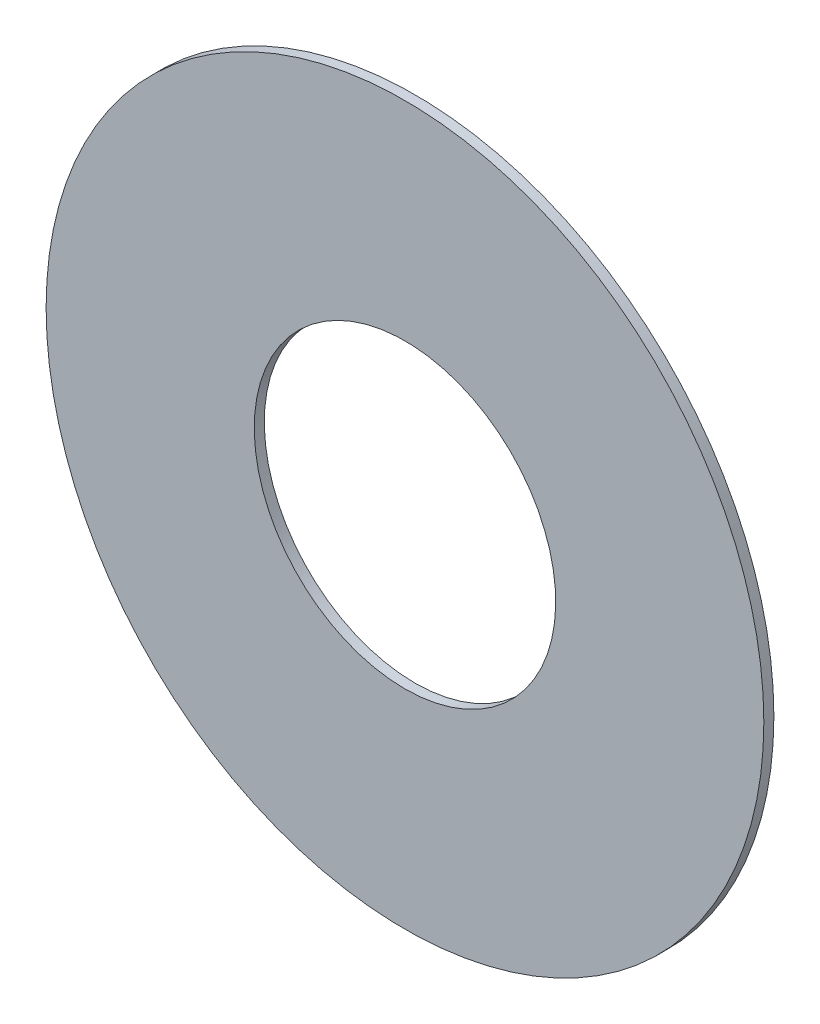
ISO-10303-21;
HEADER;
FILE_DESCRIPTION(('STEP AP214'),'2;1');
FILE_NAME('part.step','',(''),(''),'','','');
FILE_SCHEMA(('AUTOMOTIVE_DESIGN { 1 0 10303 214 1 1 1 1 }'));
ENDSEC;
DATA;
#1=APPLICATION_CONTEXT('core data for automotive mechanical design processes');
#2=APPLICATION_PROTOCOL_DEFINITION('international standard','automotive_design',2000,#1);
#3=PRODUCT_CONTEXT('',#1,'mechanical');
#4=PRODUCT('Part','Part','',(#3));
#5=PRODUCT_RELATED_PRODUCT_CATEGORY('part','',(#4));
#6=PRODUCT_DEFINITION_FORMATION('','',#4);
#7=PRODUCT_DEFINITION_CONTEXT('part definition',#1,'design');
#8=PRODUCT_DEFINITION('design','',#6,#7);
#9=PRODUCT_DEFINITION_SHAPE('','',#8);
#10=(LENGTH_UNIT() NAMED_UNIT(*) SI_UNIT(.MILLI.,.METRE.));
#11=(NAMED_UNIT(*) PLANE_ANGLE_UNIT() SI_UNIT($,.RADIAN.));
#12=(NAMED_UNIT(*) SI_UNIT($,.STERADIAN.) SOLID_ANGLE_UNIT());
#13=UNCERTAINTY_MEASURE_WITH_UNIT(LENGTH_MEASURE(1.E-05),#10,'distance_accuracy_value','');
#14=(GEOMETRIC_REPRESENTATION_CONTEXT(3) GLOBAL_UNCERTAINTY_ASSIGNED_CONTEXT((#13)) GLOBAL_UNIT_ASSIGNED_CONTEXT((#10,
#11,#12)) REPRESENTATION_CONTEXT('',''));
#15=CARTESIAN_POINT('',(0.,0.,0.));
#16=DIRECTION('',(0.,0.,1.));
#17=DIRECTION('',(1.,0.,0.));
#18=AXIS2_PLACEMENT_3D('',#15,#16,#17);
#19=CARTESIAN_POINT('',(123.952,-125.984,-0.045));
#20=DIRECTION('',(0.,0.,-1.));
#21=DIRECTION('',(0.,-1.,0.));
#22=AXIS2_PLACEMENT_3D('',#19,#20,#21);
#23=CYLINDRICAL_SURFACE('',#22,0.525);
#24=CARTESIAN_POINT('',(123.952,-125.984,1.67));
#25=DIRECTION('',(0.,0.,-1.));
#26=DIRECTION('',(0.,-1.,0.));
#27=AXIS2_PLACEMENT_3D('',#24,#25,#26);
#28=CIRCLE('',#27,0.525);
#29=CARTESIAN_POINT('',(123.952,-126.509,1.67));
#30=VERTEX_POINT('',#29);
#31=EDGE_CURVE('E26',#30,#30,#28,.T.);
#32=ORIENTED_EDGE('',*,*,#31,.T.);
#33=DIRECTION('',(0.,0.,1.));
#34=VECTOR('',#33,1.);
#35=CARTESIAN_POINT('',(123.952,-126.509,-0.045));
#36=LINE('',#35,#34);
#37=CARTESIAN_POINT('',(123.952,-126.509,1.705));
#38=VERTEX_POINT('',#37);
#39=EDGE_CURVE('E11',#30,#38,#36,.T.);
#40=ORIENTED_EDGE('',*,*,#39,.T.);
#41=CARTESIAN_POINT('',(123.952,-125.984,1.705));
#42=DIRECTION('',(0.,0.,-1.));
#43=DIRECTION('',(0.,-1.,0.));
#44=AXIS2_PLACEMENT_3D('',#41,#42,#43);
#45=CIRCLE('',#44,0.525);
#46=EDGE_CURVE('E64',#38,#38,#45,.T.);
#47=ORIENTED_EDGE('',*,*,#46,.F.);
#48=ORIENTED_EDGE('',*,*,#39,.F.);
#49=EDGE_LOOP('',(#32,#40,#47,#48));
#50=FACE_BOUND('',#49,.T.);
#51=ADVANCED_FACE('F17',(#50),#23,.F.);
#52=CARTESIAN_POINT('',(123.952,-125.984,1.67));
#53=DIRECTION('',(0.,0.,1.));
#54=DIRECTION('',(1.,0.,0.));
#55=AXIS2_PLACEMENT_3D('',#52,#53,#54);
#56=PLANE('',#55);
#57=ORIENTED_EDGE('',*,*,#31,.F.);
#58=EDGE_LOOP('',(#57));
#59=FACE_BOUND('',#58,.T.);
#60=CARTESIAN_POINT('',(123.952,-125.984,1.67));
#61=DIRECTION('',(0.,0.,1.));
#62=DIRECTION('',(1.,0.,0.));
#63=AXIS2_PLACEMENT_3D('',#60,#61,#62);
#64=CIRCLE('',#63,1.25);
#65=CARTESIAN_POINT('',(125.202,-125.984,1.67));
#66=VERTEX_POINT('',#65);
#67=EDGE_CURVE('E53',#66,#66,#64,.T.);
#68=ORIENTED_EDGE('',*,*,#67,.F.);
#69=EDGE_LOOP('',(#68));
#70=FACE_BOUND('',#69,.T.);
#71=ADVANCED_FACE('F77',(#59,#70),#56,.F.);
#72=CARTESIAN_POINT('',(123.952,-125.984,1.705));
#73=DIRECTION('',(0.,0.,1.));
#74=DIRECTION('',(1.,0.,0.));
#75=AXIS2_PLACEMENT_3D('',#72,#73,#74);
#76=PLANE('',#75);
#77=ORIENTED_EDGE('',*,*,#46,.T.);
#78=EDGE_LOOP('',(#77));
#79=FACE_BOUND('',#78,.T.);
#80=CARTESIAN_POINT('',(123.952,-125.984,1.705));
#81=DIRECTION('',(0.,0.,1.));
#82=DIRECTION('',(1.,0.,0.));
#83=AXIS2_PLACEMENT_3D('',#80,#81,#82);
#84=CIRCLE('',#83,1.25);
#85=CARTESIAN_POINT('',(125.202,-125.984,1.705));
#86=VERTEX_POINT('',#85);
#87=EDGE_CURVE('E51',#86,#86,#84,.T.);
#88=ORIENTED_EDGE('',*,*,#87,.T.);
#89=EDGE_LOOP('',(#88));
#90=FACE_BOUND('',#89,.T.);
#91=ADVANCED_FACE('F57',(#79,#90),#76,.T.);
#92=CARTESIAN_POINT('',(123.952,-125.984,1.67));
#93=DIRECTION('',(0.,0.,1.));
#94=DIRECTION('',(1.,0.,0.));
#95=AXIS2_PLACEMENT_3D('',#92,#93,#94);
#96=CYLINDRICAL_SURFACE('',#95,1.25);
#97=ORIENTED_EDGE('',*,*,#87,.F.);
#98=DIRECTION('',(0.,0.,1.));
#99=VECTOR('',#98,1.);
#100=CARTESIAN_POINT('',(125.202,-125.984,1.67));
#101=LINE('',#100,#99);
#102=EDGE_CURVE('E48',#66,#86,#101,.T.);
#103=ORIENTED_EDGE('',*,*,#102,.F.);
#104=ORIENTED_EDGE('',*,*,#67,.T.);
#105=ORIENTED_EDGE('',*,*,#102,.T.);
#106=EDGE_LOOP('',(#97,#103,#104,#105));
#107=FACE_BOUND('',#106,.T.);
#108=ADVANCED_FACE('F50',(#107),#96,.T.);
#109=CLOSED_SHELL('',(#51,#71,#91,#108));
#110=MANIFOLD_SOLID_BREP('B1',#109);
#111=ADVANCED_BREP_SHAPE_REPRESENTATION('',(#18,#110),#14);
#112=SHAPE_DEFINITION_REPRESENTATION(#9,#111);
ENDSEC;
END-ISO-10303-21;
